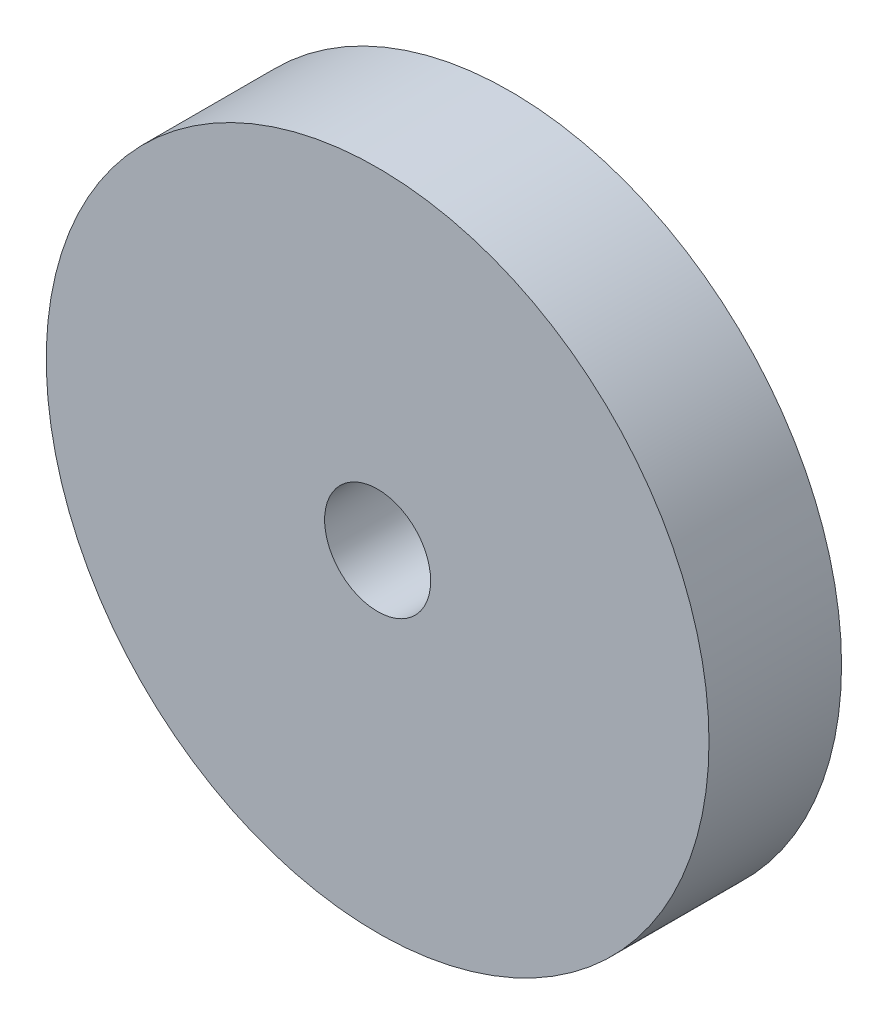
ISO-10303-21;
HEADER;
FILE_DESCRIPTION(('STEP AP214'),'2;1');
FILE_NAME('part.step','',(''),(''),'','','');
FILE_SCHEMA(('AUTOMOTIVE_DESIGN { 1 0 10303 214 1 1 1 1 }'));
ENDSEC;
DATA;
#1=APPLICATION_CONTEXT('core data for automotive mechanical design processes');
#2=APPLICATION_PROTOCOL_DEFINITION('international standard','automotive_design',2000,#1);
#3=PRODUCT_CONTEXT('',#1,'mechanical');
#4=PRODUCT('Part','Part','',(#3));
#5=PRODUCT_RELATED_PRODUCT_CATEGORY('part','',(#4));
#6=PRODUCT_DEFINITION_FORMATION('','',#4);
#7=PRODUCT_DEFINITION_CONTEXT('part definition',#1,'design');
#8=PRODUCT_DEFINITION('design','',#6,#7);
#9=PRODUCT_DEFINITION_SHAPE('','',#8);
#10=(LENGTH_UNIT() NAMED_UNIT(*) SI_UNIT(.MILLI.,.METRE.));
#11=(NAMED_UNIT(*) PLANE_ANGLE_UNIT() SI_UNIT($,.RADIAN.));
#12=(NAMED_UNIT(*) SI_UNIT($,.STERADIAN.) SOLID_ANGLE_UNIT());
#13=UNCERTAINTY_MEASURE_WITH_UNIT(LENGTH_MEASURE(1.E-05),#10,'distance_accuracy_value','');
#14=(GEOMETRIC_REPRESENTATION_CONTEXT(3) GLOBAL_UNCERTAINTY_ASSIGNED_CONTEXT((#13)) GLOBAL_UNIT_ASSIGNED_CONTEXT((#10,
#11,#12)) REPRESENTATION_CONTEXT('',''));
#15=CARTESIAN_POINT('',(0.,0.,0.));
#16=DIRECTION('',(0.,0.,1.));
#17=DIRECTION('',(1.,0.,0.));
#18=AXIS2_PLACEMENT_3D('',#15,#16,#17);
#19=CARTESIAN_POINT('',(-98.4635783674477,-276.505149473541,4.));
#20=DIRECTION('',(0.,0.,-1.));
#21=DIRECTION('',(-1.,0.,0.));
#22=AXIS2_PLACEMENT_3D('',#19,#20,#21);
#23=CYLINDRICAL_SURFACE('',#22,10.);
#24=CARTESIAN_POINT('',(-98.4635783674477,-276.505149473541,4.));
#25=DIRECTION('',(0.,0.,1.));
#26=DIRECTION('',(1.,0.,0.));
#27=AXIS2_PLACEMENT_3D('',#24,#25,#26);
#28=CIRCLE('',#27,10.);
#29=CARTESIAN_POINT('',(-88.4635783674477,-276.505149473541,4.));
#30=VERTEX_POINT('',#29);
#31=EDGE_CURVE('E10',#30,#30,#28,.T.);
#32=ORIENTED_EDGE('',*,*,#31,.F.);
#33=EDGE_LOOP('',(#32));
#34=FACE_BOUND('',#33,.T.);
#35=CARTESIAN_POINT('',(-98.4635783674477,-276.505149473541,0.));
#36=DIRECTION('',(0.,0.,1.));
#37=DIRECTION('',(1.,0.,0.));
#38=AXIS2_PLACEMENT_3D('',#35,#36,#37);
#39=CIRCLE('',#38,10.);
#40=CARTESIAN_POINT('',(-88.4635783674477,-276.505149473541,0.));
#41=VERTEX_POINT('',#40);
#42=EDGE_CURVE('E33',#41,#41,#39,.T.);
#43=ORIENTED_EDGE('',*,*,#42,.T.);
#44=EDGE_LOOP('',(#43));
#45=FACE_BOUND('',#44,.T.);
#46=ADVANCED_FACE('F30',(#34,#45),#23,.T.);
#47=CARTESIAN_POINT('',(-98.4635783674477,-276.505149473541,4.));
#48=DIRECTION('',(0.,0.,1.));
#49=DIRECTION('',(1.,0.,0.));
#50=AXIS2_PLACEMENT_3D('',#47,#48,#49);
#51=PLANE('',#50);
#52=CARTESIAN_POINT('',(-98.4635783674477,-276.505149473541,4.));
#53=DIRECTION('',(0.,0.,1.));
#54=DIRECTION('',(1.,0.,0.));
#55=AXIS2_PLACEMENT_3D('',#52,#53,#54);
#56=CIRCLE('',#55,1.59999999999999);
#57=CARTESIAN_POINT('',(-96.8635783674477,-276.505149473541,4.));
#58=VERTEX_POINT('',#57);
#59=EDGE_CURVE('E44',#58,#58,#56,.T.);
#60=ORIENTED_EDGE('',*,*,#59,.F.);
#61=EDGE_LOOP('',(#60));
#62=FACE_BOUND('',#61,.T.);
#63=ORIENTED_EDGE('',*,*,#31,.T.);
#64=EDGE_LOOP('',(#63));
#65=FACE_BOUND('',#64,.T.);
#66=ADVANCED_FACE('F50',(#62,#65),#51,.T.);
#67=CARTESIAN_POINT('',(-98.4635783674477,-276.505149473541,0.));
#68=DIRECTION('',(0.,0.,1.));
#69=DIRECTION('',(1.,0.,0.));
#70=AXIS2_PLACEMENT_3D('',#67,#68,#69);
#71=PLANE('',#70);
#72=CARTESIAN_POINT('',(-98.4635783674477,-276.505149473541,0.));
#73=DIRECTION('',(0.,0.,1.));
#74=DIRECTION('',(1.,0.,0.));
#75=AXIS2_PLACEMENT_3D('',#72,#73,#74);
#76=CIRCLE('',#75,1.59999999999999);
#77=CARTESIAN_POINT('',(-96.8635783674477,-276.505149473541,0.));
#78=VERTEX_POINT('',#77);
#79=EDGE_CURVE('E40',#78,#78,#76,.T.);
#80=ORIENTED_EDGE('',*,*,#79,.T.);
#81=EDGE_LOOP('',(#80));
#82=FACE_BOUND('',#81,.T.);
#83=ORIENTED_EDGE('',*,*,#42,.F.);
#84=EDGE_LOOP('',(#83));
#85=FACE_BOUND('',#84,.T.);
#86=ADVANCED_FACE('F52',(#82,#85),#71,.F.);
#87=CARTESIAN_POINT('',(-98.4635783674477,-276.505149473541,4.));
#88=DIRECTION('',(0.,0.,1.));
#89=DIRECTION('',(1.,0.,0.));
#90=AXIS2_PLACEMENT_3D('',#87,#88,#89);
#91=CYLINDRICAL_SURFACE('',#90,1.59999999999999);
#92=ORIENTED_EDGE('',*,*,#79,.F.);
#93=EDGE_LOOP('',(#92));
#94=FACE_BOUND('',#93,.T.);
#95=ORIENTED_EDGE('',*,*,#59,.T.);
#96=EDGE_LOOP('',(#95));
#97=FACE_BOUND('',#96,.T.);
#98=ADVANCED_FACE('F48',(#94,#97),#91,.F.);
#99=CLOSED_SHELL('',(#46,#66,#86,#98));
#100=MANIFOLD_SOLID_BREP('B2',#99);
#101=ADVANCED_BREP_SHAPE_REPRESENTATION('',(#18,#100),#14);
#102=SHAPE_DEFINITION_REPRESENTATION(#9,#101);
ENDSEC;
END-ISO-10303-21;
